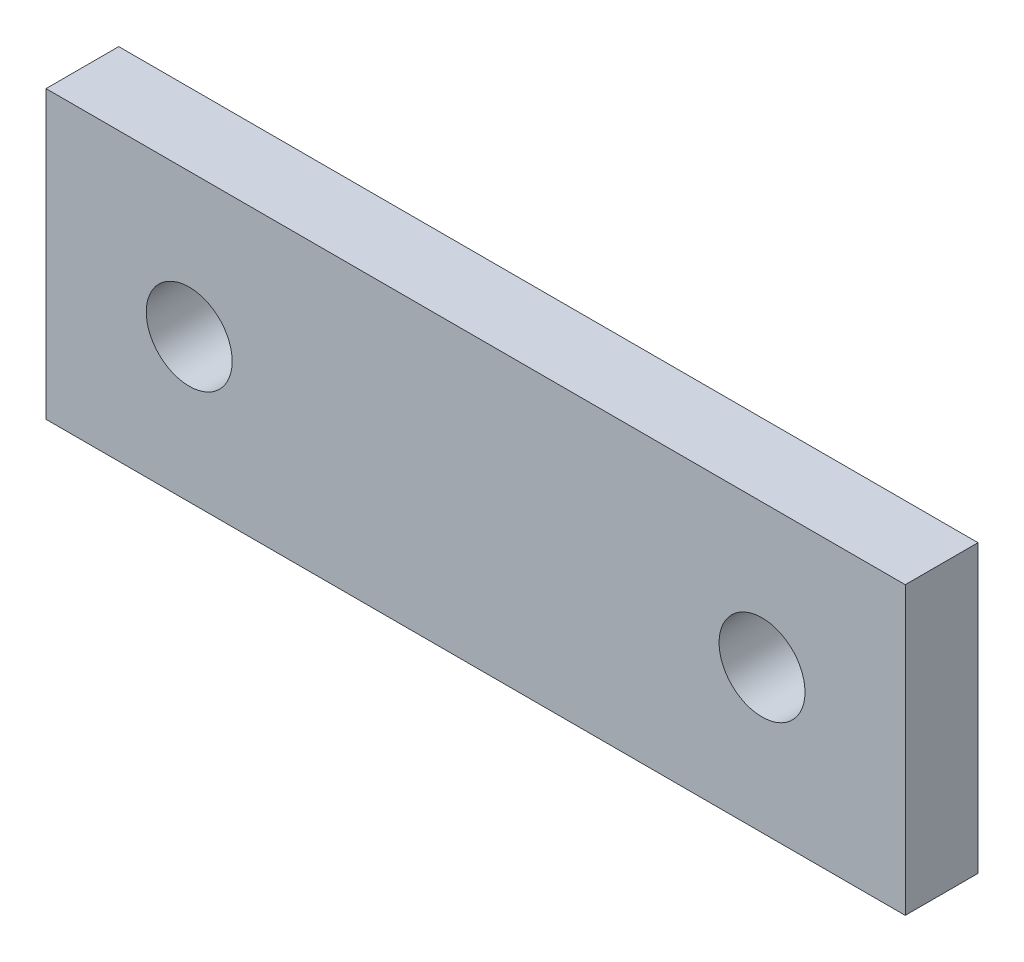
ISO-10303-21;
HEADER;
FILE_DESCRIPTION(('STEP AP214'),'2;1');
FILE_NAME('part.step','',(''),(''),'','','');
FILE_SCHEMA(('AUTOMOTIVE_DESIGN { 1 0 10303 214 1 1 1 1 }'));
ENDSEC;
DATA;
#1=APPLICATION_CONTEXT('core data for automotive mechanical design processes');
#2=APPLICATION_PROTOCOL_DEFINITION('international standard','automotive_design',2000,#1);
#3=PRODUCT_CONTEXT('',#1,'mechanical');
#4=PRODUCT('Part','Part','',(#3));
#5=PRODUCT_RELATED_PRODUCT_CATEGORY('part','',(#4));
#6=PRODUCT_DEFINITION_FORMATION('','',#4);
#7=PRODUCT_DEFINITION_CONTEXT('part definition',#1,'design');
#8=PRODUCT_DEFINITION('design','',#6,#7);
#9=PRODUCT_DEFINITION_SHAPE('','',#8);
#10=(LENGTH_UNIT() NAMED_UNIT(*) SI_UNIT(.MILLI.,.METRE.));
#11=(NAMED_UNIT(*) PLANE_ANGLE_UNIT() SI_UNIT($,.RADIAN.));
#12=(NAMED_UNIT(*) SI_UNIT($,.STERADIAN.) SOLID_ANGLE_UNIT());
#13=UNCERTAINTY_MEASURE_WITH_UNIT(LENGTH_MEASURE(1.E-05),#10,'distance_accuracy_value','');
#14=(GEOMETRIC_REPRESENTATION_CONTEXT(3) GLOBAL_UNCERTAINTY_ASSIGNED_CONTEXT((#13)) GLOBAL_UNIT_ASSIGNED_CONTEXT((#10,
#11,#12)) REPRESENTATION_CONTEXT('',''));
#15=CARTESIAN_POINT('',(0.,0.,0.));
#16=DIRECTION('',(0.,0.,1.));
#17=DIRECTION('',(1.,0.,0.));
#18=AXIS2_PLACEMENT_3D('',#15,#16,#17);
#19=CARTESIAN_POINT('',(0.,0.,2.54));
#20=DIRECTION('',(0.,0.,1.));
#21=DIRECTION('',(1.,0.,0.));
#22=AXIS2_PLACEMENT_3D('',#19,#20,#21);
#23=PLANE('',#22);
#24=CARTESIAN_POINT('',(-26.6561643835616,1.35,2.54));
#25=DIRECTION('',(0.,0.,1.));
#26=DIRECTION('',(1.,0.,0.));
#27=AXIS2_PLACEMENT_3D('',#24,#25,#26);
#28=CIRCLE('',#27,1.5);
#29=CARTESIAN_POINT('',(-25.1561643835616,1.35,2.54));
#30=VERTEX_POINT('',#29);
#31=EDGE_CURVE('E123',#30,#30,#28,.T.);
#32=ORIENTED_EDGE('',*,*,#31,.F.);
#33=EDGE_LOOP('',(#32));
#34=FACE_BOUND('',#33,.T.);
#35=DIRECTION('',(0.,-1.,0.));
#36=VECTOR('',#35,1.);
#37=CARTESIAN_POINT('',(-31.6561643835616,6.35,2.54));
#38=LINE('',#37,#36);
#39=CARTESIAN_POINT('',(-31.6561643835616,6.35,2.54));
#40=VERTEX_POINT('',#39);
#41=CARTESIAN_POINT('',(-31.6561643835616,-3.65,2.54));
#42=VERTEX_POINT('',#41);
#43=EDGE_CURVE('E93',#40,#42,#38,.T.);
#44=ORIENTED_EDGE('',*,*,#43,.T.);
#45=DIRECTION('',(1.,0.,0.));
#46=VECTOR('',#45,1.);
#47=CARTESIAN_POINT('',(-31.6561643835616,-3.65,2.54));
#48=LINE('',#47,#46);
#49=CARTESIAN_POINT('',(-1.65616438356164,-3.65,2.54));
#50=VERTEX_POINT('',#49);
#51=EDGE_CURVE('E88',#42,#50,#48,.T.);
#52=ORIENTED_EDGE('',*,*,#51,.T.);
#53=DIRECTION('',(0.,1.,0.));
#54=VECTOR('',#53,1.);
#55=CARTESIAN_POINT('',(-1.65616438356164,6.35,2.54));
#56=LINE('',#55,#54);
#57=CARTESIAN_POINT('',(-1.65616438356164,6.35,2.54));
#58=VERTEX_POINT('',#57);
#59=EDGE_CURVE('E91',#50,#58,#56,.T.);
#60=ORIENTED_EDGE('',*,*,#59,.T.);
#61=DIRECTION('',(-1.,0.,0.));
#62=VECTOR('',#61,1.);
#63=CARTESIAN_POINT('',(-31.6561643835616,6.35,2.54));
#64=LINE('',#63,#62);
#65=EDGE_CURVE('E58',#58,#40,#64,.T.);
#66=ORIENTED_EDGE('',*,*,#65,.T.);
#67=EDGE_LOOP('',(#44,#52,#60,#66));
#68=FACE_BOUND('',#67,.T.);
#69=CARTESIAN_POINT('',(-6.65616438356164,1.35,2.54));
#70=DIRECTION('',(0.,0.,1.));
#71=DIRECTION('',(1.,0.,0.));
#72=AXIS2_PLACEMENT_3D('',#69,#70,#71);
#73=CIRCLE('',#72,1.5);
#74=CARTESIAN_POINT('',(-5.15616438356164,1.35,2.54));
#75=VERTEX_POINT('',#74);
#76=EDGE_CURVE('E124',#75,#75,#73,.T.);
#77=ORIENTED_EDGE('',*,*,#76,.F.);
#78=EDGE_LOOP('',(#77));
#79=FACE_BOUND('',#78,.T.);
#80=ADVANCED_FACE('F40',(#34,#68,#79),#23,.T.);
#81=CARTESIAN_POINT('',(0.,0.,0.));
#82=DIRECTION('',(0.,0.,1.));
#83=DIRECTION('',(1.,0.,0.));
#84=AXIS2_PLACEMENT_3D('',#81,#82,#83);
#85=PLANE('',#84);
#86=DIRECTION('',(0.,-1.,0.));
#87=VECTOR('',#86,1.);
#88=CARTESIAN_POINT('',(-31.6561643835616,6.35,0.));
#89=LINE('',#88,#87);
#90=CARTESIAN_POINT('',(-31.6561643835616,6.35,0.));
#91=VERTEX_POINT('',#90);
#92=CARTESIAN_POINT('',(-31.6561643835616,-3.65,0.));
#93=VERTEX_POINT('',#92);
#94=EDGE_CURVE('E129',#91,#93,#89,.T.);
#95=ORIENTED_EDGE('',*,*,#94,.F.);
#96=DIRECTION('',(-1.,0.,0.));
#97=VECTOR('',#96,1.);
#98=CARTESIAN_POINT('',(-31.6561643835616,6.35,0.));
#99=LINE('',#98,#97);
#100=CARTESIAN_POINT('',(-1.65616438356164,6.35,0.));
#101=VERTEX_POINT('',#100);
#102=EDGE_CURVE('E81',#101,#91,#99,.T.);
#103=ORIENTED_EDGE('',*,*,#102,.F.);
#104=DIRECTION('',(0.,1.,0.));
#105=VECTOR('',#104,1.);
#106=CARTESIAN_POINT('',(-1.65616438356164,6.35,0.));
#107=LINE('',#106,#105);
#108=CARTESIAN_POINT('',(-1.65616438356164,-3.65,0.));
#109=VERTEX_POINT('',#108);
#110=EDGE_CURVE('E75',#109,#101,#107,.T.);
#111=ORIENTED_EDGE('',*,*,#110,.F.);
#112=DIRECTION('',(1.,0.,0.));
#113=VECTOR('',#112,1.);
#114=CARTESIAN_POINT('',(-31.6561643835616,-3.65,0.));
#115=LINE('',#114,#113);
#116=EDGE_CURVE('E98',#93,#109,#115,.T.);
#117=ORIENTED_EDGE('',*,*,#116,.F.);
#118=EDGE_LOOP('',(#95,#103,#111,#117));
#119=FACE_BOUND('',#118,.T.);
#120=CARTESIAN_POINT('',(-26.6561643835616,1.35,0.));
#121=DIRECTION('',(0.,0.,1.));
#122=DIRECTION('',(1.,0.,0.));
#123=AXIS2_PLACEMENT_3D('',#120,#121,#122);
#124=CIRCLE('',#123,1.5);
#125=CARTESIAN_POINT('',(-25.1561643835616,1.35,0.));
#126=VERTEX_POINT('',#125);
#127=EDGE_CURVE('E120',#126,#126,#124,.T.);
#128=ORIENTED_EDGE('',*,*,#127,.T.);
#129=EDGE_LOOP('',(#128));
#130=FACE_BOUND('',#129,.T.);
#131=CARTESIAN_POINT('',(-6.65616438356164,1.35,0.));
#132=DIRECTION('',(0.,0.,1.));
#133=DIRECTION('',(1.,0.,0.));
#134=AXIS2_PLACEMENT_3D('',#131,#132,#133);
#135=CIRCLE('',#134,1.5);
#136=CARTESIAN_POINT('',(-5.15616438356164,1.35,0.));
#137=VERTEX_POINT('',#136);
#138=EDGE_CURVE('E130',#137,#137,#135,.T.);
#139=ORIENTED_EDGE('',*,*,#138,.T.);
#140=EDGE_LOOP('',(#139));
#141=FACE_BOUND('',#140,.T.);
#142=ADVANCED_FACE('F141',(#119,#130,#141),#85,.F.);
#143=CARTESIAN_POINT('',(-31.6561643835616,6.35,2.54));
#144=DIRECTION('',(1.,0.,0.));
#145=DIRECTION('',(0.,0.,-1.));
#146=AXIS2_PLACEMENT_3D('',#143,#144,#145);
#147=PLANE('',#146);
#148=ORIENTED_EDGE('',*,*,#94,.T.);
#149=DIRECTION('',(0.,0.,-1.));
#150=VECTOR('',#149,1.);
#151=CARTESIAN_POINT('',(-31.6561643835616,-3.65,2.54));
#152=LINE('',#151,#150);
#153=EDGE_CURVE('E12',#42,#93,#152,.T.);
#154=ORIENTED_EDGE('',*,*,#153,.F.);
#155=ORIENTED_EDGE('',*,*,#43,.F.);
#156=DIRECTION('',(0.,0.,-1.));
#157=VECTOR('',#156,1.);
#158=CARTESIAN_POINT('',(-31.6561643835616,6.35,2.54));
#159=LINE('',#158,#157);
#160=EDGE_CURVE('E105',#40,#91,#159,.T.);
#161=ORIENTED_EDGE('',*,*,#160,.T.);
#162=EDGE_LOOP('',(#148,#154,#155,#161));
#163=FACE_BOUND('',#162,.T.);
#164=ADVANCED_FACE('F42',(#163),#147,.F.);
#165=CARTESIAN_POINT('',(-31.6561643835616,-3.65,2.54));
#166=DIRECTION('',(0.,1.,0.));
#167=DIRECTION('',(0.,0.,1.));
#168=AXIS2_PLACEMENT_3D('',#165,#166,#167);
#169=PLANE('',#168);
#170=ORIENTED_EDGE('',*,*,#116,.T.);
#171=DIRECTION('',(0.,0.,-1.));
#172=VECTOR('',#171,1.);
#173=CARTESIAN_POINT('',(-1.65616438356164,-3.65,2.54));
#174=LINE('',#173,#172);
#175=EDGE_CURVE('E50',#50,#109,#174,.T.);
#176=ORIENTED_EDGE('',*,*,#175,.F.);
#177=ORIENTED_EDGE('',*,*,#51,.F.);
#178=ORIENTED_EDGE('',*,*,#153,.T.);
#179=EDGE_LOOP('',(#170,#176,#177,#178));
#180=FACE_BOUND('',#179,.T.);
#181=ADVANCED_FACE('F97',(#180),#169,.F.);
#182=CARTESIAN_POINT('',(-1.65616438356164,6.35,2.54));
#183=DIRECTION('',(-1.,0.,0.));
#184=DIRECTION('',(0.,-1.,0.));
#185=AXIS2_PLACEMENT_3D('',#182,#183,#184);
#186=PLANE('',#185);
#187=ORIENTED_EDGE('',*,*,#110,.T.);
#188=DIRECTION('',(0.,0.,-1.));
#189=VECTOR('',#188,1.);
#190=CARTESIAN_POINT('',(-1.65616438356164,6.35,2.54));
#191=LINE('',#190,#189);
#192=EDGE_CURVE('E100',#58,#101,#191,.T.);
#193=ORIENTED_EDGE('',*,*,#192,.F.);
#194=ORIENTED_EDGE('',*,*,#59,.F.);
#195=ORIENTED_EDGE('',*,*,#175,.T.);
#196=EDGE_LOOP('',(#187,#193,#194,#195));
#197=FACE_BOUND('',#196,.T.);
#198=ADVANCED_FACE('F101',(#197),#186,.F.);
#199=CARTESIAN_POINT('',(-31.6561643835616,6.35,2.54));
#200=DIRECTION('',(0.,-1.,0.));
#201=DIRECTION('',(0.,0.,-1.));
#202=AXIS2_PLACEMENT_3D('',#199,#200,#201);
#203=PLANE('',#202);
#204=ORIENTED_EDGE('',*,*,#102,.T.);
#205=ORIENTED_EDGE('',*,*,#160,.F.);
#206=ORIENTED_EDGE('',*,*,#65,.F.);
#207=ORIENTED_EDGE('',*,*,#192,.T.);
#208=EDGE_LOOP('',(#204,#205,#206,#207));
#209=FACE_BOUND('',#208,.T.);
#210=ADVANCED_FACE('F154',(#209),#203,.F.);
#211=CARTESIAN_POINT('',(-26.6561643835616,1.35,2.54));
#212=DIRECTION('',(0.,0.,-1.));
#213=DIRECTION('',(-1.,0.,0.));
#214=AXIS2_PLACEMENT_3D('',#211,#212,#213);
#215=CYLINDRICAL_SURFACE('',#214,1.5);
#216=ORIENTED_EDGE('',*,*,#31,.T.);
#217=EDGE_LOOP('',(#216));
#218=FACE_BOUND('',#217,.T.);
#219=ORIENTED_EDGE('',*,*,#127,.F.);
#220=EDGE_LOOP('',(#219));
#221=FACE_BOUND('',#220,.T.);
#222=ADVANCED_FACE('F151',(#218,#221),#215,.F.);
#223=CARTESIAN_POINT('',(-6.65616438356164,1.35,2.54));
#224=DIRECTION('',(0.,0.,-1.));
#225=DIRECTION('',(-1.,0.,0.));
#226=AXIS2_PLACEMENT_3D('',#223,#224,#225);
#227=CYLINDRICAL_SURFACE('',#226,1.5);
#228=ORIENTED_EDGE('',*,*,#76,.T.);
#229=EDGE_LOOP('',(#228));
#230=FACE_BOUND('',#229,.T.);
#231=ORIENTED_EDGE('',*,*,#138,.F.);
#232=EDGE_LOOP('',(#231));
#233=FACE_BOUND('',#232,.T.);
#234=ADVANCED_FACE('F138',(#230,#233),#227,.F.);
#235=CLOSED_SHELL('',(#80,#142,#164,#181,#198,#210,#222,#234));
#236=MANIFOLD_SOLID_BREP('B2',#235);
#237=ADVANCED_BREP_SHAPE_REPRESENTATION('',(#18,#236),#14);
#238=SHAPE_DEFINITION_REPRESENTATION(#9,#237);
ENDSEC;
END-ISO-10303-21;
